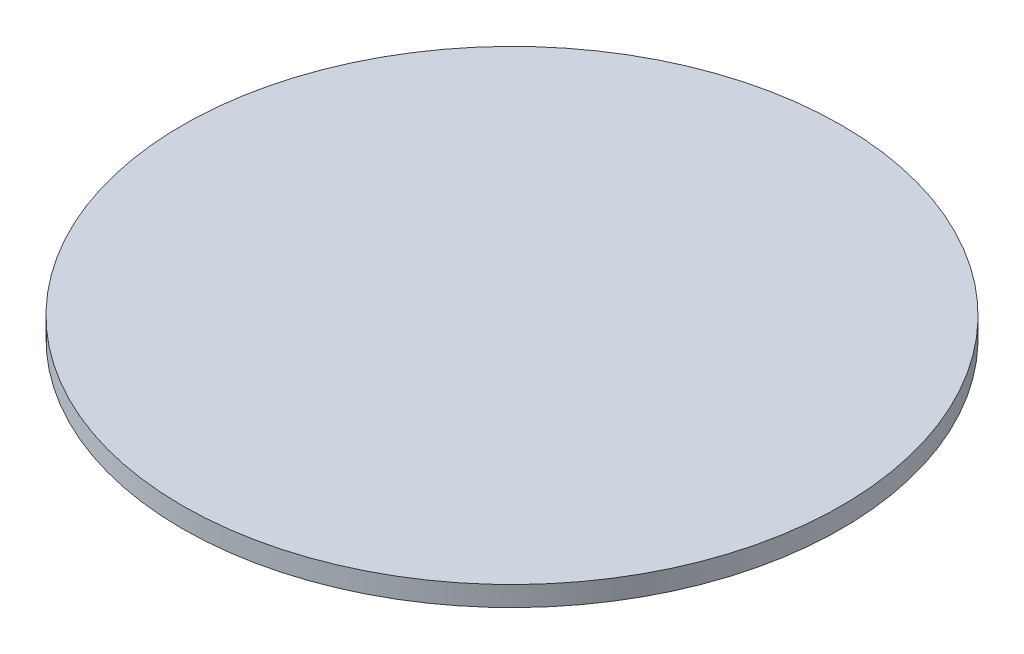
ISO-10303-21;
HEADER;
FILE_DESCRIPTION(('STEP AP214'),'2;1');
FILE_NAME('part.step','',(''),(''),'','','');
FILE_SCHEMA(('AUTOMOTIVE_DESIGN { 1 0 10303 214 1 1 1 1 }'));
ENDSEC;
DATA;
#1=APPLICATION_CONTEXT('core data for automotive mechanical design processes');
#2=APPLICATION_PROTOCOL_DEFINITION('international standard','automotive_design',2000,#1);
#3=PRODUCT_CONTEXT('',#1,'mechanical');
#4=PRODUCT('Part','Part','',(#3));
#5=PRODUCT_RELATED_PRODUCT_CATEGORY('part','',(#4));
#6=PRODUCT_DEFINITION_FORMATION('','',#4);
#7=PRODUCT_DEFINITION_CONTEXT('part definition',#1,'design');
#8=PRODUCT_DEFINITION('design','',#6,#7);
#9=PRODUCT_DEFINITION_SHAPE('','',#8);
#10=(LENGTH_UNIT() NAMED_UNIT(*) SI_UNIT(.MILLI.,.METRE.));
#11=(NAMED_UNIT(*) PLANE_ANGLE_UNIT() SI_UNIT($,.RADIAN.));
#12=(NAMED_UNIT(*) SI_UNIT($,.STERADIAN.) SOLID_ANGLE_UNIT());
#13=UNCERTAINTY_MEASURE_WITH_UNIT(LENGTH_MEASURE(1.E-05),#10,'distance_accuracy_value','');
#14=(GEOMETRIC_REPRESENTATION_CONTEXT(3) GLOBAL_UNCERTAINTY_ASSIGNED_CONTEXT((#13)) GLOBAL_UNIT_ASSIGNED_CONTEXT((#10,
#11,#12)) REPRESENTATION_CONTEXT('',''));
#15=CARTESIAN_POINT('',(0.,0.,0.));
#16=DIRECTION('',(0.,0.,1.));
#17=DIRECTION('',(1.,0.,0.));
#18=AXIS2_PLACEMENT_3D('',#15,#16,#17);
#19=CARTESIAN_POINT('',(13.5,0.,0.));
#20=DIRECTION('',(0.,-1.,0.));
#21=DIRECTION('',(0.,0.,-1.));
#22=AXIS2_PLACEMENT_3D('',#19,#20,#21);
#23=PLANE('',#22);
#24=CARTESIAN_POINT('',(0.,0.,0.));
#25=DIRECTION('',(0.,-1.,0.));
#26=DIRECTION('',(0.,0.,-1.));
#27=AXIS2_PLACEMENT_3D('',#24,#25,#26);
#28=CIRCLE('',#27,13.5);
#29=CARTESIAN_POINT('',(0.,0.,-13.5));
#30=VERTEX_POINT('',#29);
#31=EDGE_CURVE('E47',#30,#30,#28,.T.);
#32=ORIENTED_EDGE('',*,*,#31,.T.);
#33=EDGE_LOOP('',(#32));
#34=FACE_BOUND('',#33,.T.);
#35=ADVANCED_FACE('F33',(#34),#23,.T.);
#36=CARTESIAN_POINT('',(0.,2.,0.));
#37=DIRECTION('',(0.,1.,0.));
#38=DIRECTION('',(0.,0.,1.));
#39=AXIS2_PLACEMENT_3D('',#36,#37,#38);
#40=PLANE('',#39);
#41=CARTESIAN_POINT('',(0.,2.,0.));
#42=DIRECTION('',(0.,-1.,0.));
#43=DIRECTION('',(0.,0.,-1.));
#44=AXIS2_PLACEMENT_3D('',#41,#42,#43);
#45=CIRCLE('',#44,16.5);
#46=CARTESIAN_POINT('',(0.,2.,-16.5));
#47=VERTEX_POINT('',#46);
#48=EDGE_CURVE('E10',#47,#47,#45,.T.);
#49=ORIENTED_EDGE('',*,*,#48,.F.);
#50=EDGE_LOOP('',(#49));
#51=FACE_BOUND('',#50,.T.);
#52=ADVANCED_FACE('F65',(#51),#40,.T.);
#53=CARTESIAN_POINT('',(0.,0.,0.));
#54=DIRECTION('',(0.,-1.,0.));
#55=DIRECTION('',(0.,0.,-1.));
#56=AXIS2_PLACEMENT_3D('',#53,#54,#55);
#57=CYLINDRICAL_SURFACE('',#56,16.5);
#58=ORIENTED_EDGE('',*,*,#48,.T.);
#59=EDGE_LOOP('',(#58));
#60=FACE_BOUND('',#59,.T.);
#61=CARTESIAN_POINT('',(0.,1.,0.));
#62=DIRECTION('',(0.,-1.,0.));
#63=DIRECTION('',(0.,0.,-1.));
#64=AXIS2_PLACEMENT_3D('',#61,#62,#63);
#65=CIRCLE('',#64,16.5);
#66=CARTESIAN_POINT('',(0.,1.,-16.5));
#67=VERTEX_POINT('',#66);
#68=EDGE_CURVE('E39',#67,#67,#65,.T.);
#69=ORIENTED_EDGE('',*,*,#68,.F.);
#70=EDGE_LOOP('',(#69));
#71=FACE_BOUND('',#70,.T.);
#72=ADVANCED_FACE('F62',(#60,#71),#57,.T.);
#73=CARTESIAN_POINT('',(16.5,1.,0.));
#74=DIRECTION('',(0.,-1.,0.));
#75=DIRECTION('',(0.,0.,-1.));
#76=AXIS2_PLACEMENT_3D('',#73,#74,#75);
#77=PLANE('',#76);
#78=ORIENTED_EDGE('',*,*,#68,.T.);
#79=EDGE_LOOP('',(#78));
#80=FACE_BOUND('',#79,.T.);
#81=CARTESIAN_POINT('',(0.,1.,0.));
#82=DIRECTION('',(0.,-1.,0.));
#83=DIRECTION('',(0.,0.,-1.));
#84=AXIS2_PLACEMENT_3D('',#81,#82,#83);
#85=CIRCLE('',#84,13.5);
#86=CARTESIAN_POINT('',(0.,1.,-13.5));
#87=VERTEX_POINT('',#86);
#88=EDGE_CURVE('E43',#87,#87,#85,.T.);
#89=ORIENTED_EDGE('',*,*,#88,.F.);
#90=EDGE_LOOP('',(#89));
#91=FACE_BOUND('',#90,.T.);
#92=ADVANCED_FACE('F56',(#80,#91),#77,.T.);
#93=CARTESIAN_POINT('',(0.,0.,0.));
#94=DIRECTION('',(0.,-1.,0.));
#95=DIRECTION('',(0.,0.,-1.));
#96=AXIS2_PLACEMENT_3D('',#93,#94,#95);
#97=CYLINDRICAL_SURFACE('',#96,13.5);
#98=ORIENTED_EDGE('',*,*,#88,.T.);
#99=EDGE_LOOP('',(#98));
#100=FACE_BOUND('',#99,.T.);
#101=ORIENTED_EDGE('',*,*,#31,.F.);
#102=EDGE_LOOP('',(#101));
#103=FACE_BOUND('',#102,.T.);
#104=ADVANCED_FACE('F54',(#100,#103),#97,.T.);
#105=CLOSED_SHELL('',(#35,#52,#72,#92,#104));
#106=MANIFOLD_SOLID_BREP('B2',#105);
#107=ADVANCED_BREP_SHAPE_REPRESENTATION('',(#18,#106),#14);
#108=SHAPE_DEFINITION_REPRESENTATION(#9,#107);
ENDSEC;
END-ISO-10303-21;
